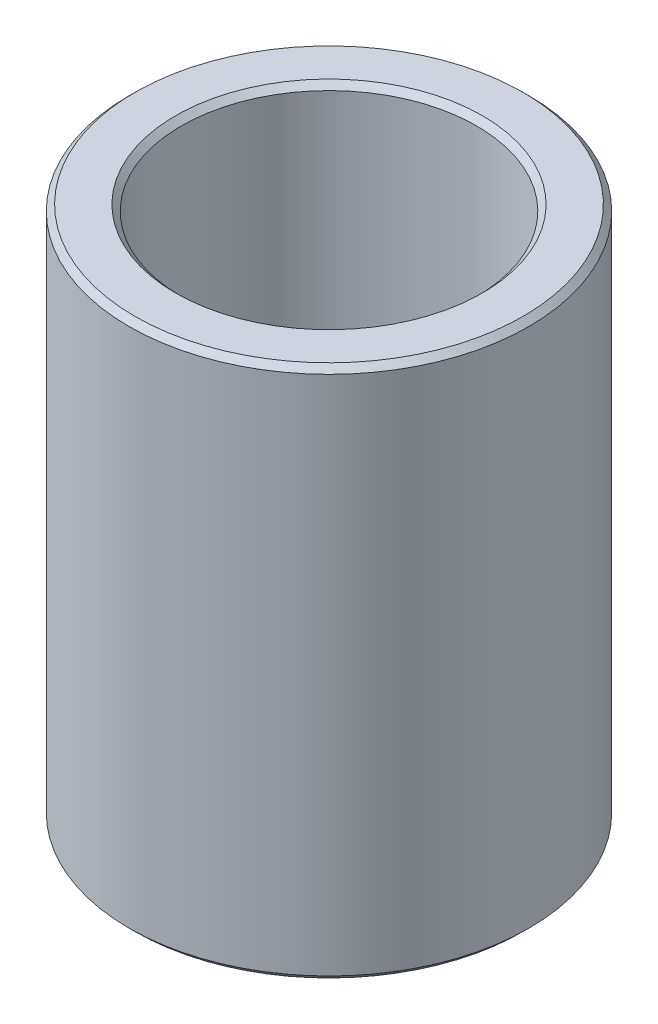
ISO-10303-21;
HEADER;
FILE_DESCRIPTION(('STEP AP214'),'2;1');
FILE_NAME('part.step','',(''),(''),'','','');
FILE_SCHEMA(('AUTOMOTIVE_DESIGN { 1 0 10303 214 1 1 1 1 }'));
ENDSEC;
DATA;
#1=APPLICATION_CONTEXT('core data for automotive mechanical design processes');
#2=APPLICATION_PROTOCOL_DEFINITION('international standard','automotive_design',2000,#1);
#3=PRODUCT_CONTEXT('',#1,'mechanical');
#4=PRODUCT('Part','Part','',(#3));
#5=PRODUCT_RELATED_PRODUCT_CATEGORY('part','',(#4));
#6=PRODUCT_DEFINITION_FORMATION('','',#4);
#7=PRODUCT_DEFINITION_CONTEXT('part definition',#1,'design');
#8=PRODUCT_DEFINITION('design','',#6,#7);
#9=PRODUCT_DEFINITION_SHAPE('','',#8);
#10=(LENGTH_UNIT() NAMED_UNIT(*) SI_UNIT(.MILLI.,.METRE.));
#11=(NAMED_UNIT(*) PLANE_ANGLE_UNIT() SI_UNIT($,.RADIAN.));
#12=(NAMED_UNIT(*) SI_UNIT($,.STERADIAN.) SOLID_ANGLE_UNIT());
#13=UNCERTAINTY_MEASURE_WITH_UNIT(LENGTH_MEASURE(1.E-05),#10,'distance_accuracy_value','');
#14=(GEOMETRIC_REPRESENTATION_CONTEXT(3) GLOBAL_UNCERTAINTY_ASSIGNED_CONTEXT((#13)) GLOBAL_UNIT_ASSIGNED_CONTEXT((#10,
#11,#12)) REPRESENTATION_CONTEXT('',''));
#15=CARTESIAN_POINT('',(0.,0.,0.));
#16=DIRECTION('',(0.,0.,1.));
#17=DIRECTION('',(1.,0.,0.));
#18=AXIS2_PLACEMENT_3D('',#15,#16,#17);
#19=CARTESIAN_POINT('',(0.,139.917964699464,0.));
#20=DIRECTION('',(0.,-1.,0.));
#21=DIRECTION('',(0.,0.,-1.));
#22=AXIS2_PLACEMENT_3D('',#19,#20,#21);
#23=CYLINDRICAL_SURFACE('',#22,52.5);
#24=CARTESIAN_POINT('',(0.,1.53916398300438,0.));
#25=DIRECTION('',(0.,1.,0.));
#26=DIRECTION('',(0.,0.,1.));
#27=AXIS2_PLACEMENT_3D('',#24,#25,#26);
#28=CIRCLE('',#27,52.5);
#29=CARTESIAN_POINT('',(0.,1.53916398300438,52.5));
#30=VERTEX_POINT('',#29);
#31=EDGE_CURVE('E10',#30,#30,#28,.T.);
#32=ORIENTED_EDGE('',*,*,#31,.T.);
#33=EDGE_LOOP('',(#32));
#34=FACE_BOUND('',#33,.T.);
#35=CARTESIAN_POINT('',(0.,138.37880071646,0.));
#36=DIRECTION('',(0.,1.,0.));
#37=DIRECTION('',(0.,0.,1.));
#38=AXIS2_PLACEMENT_3D('',#35,#36,#37);
#39=CIRCLE('',#38,52.5);
#40=CARTESIAN_POINT('',(0.,138.37880071646,52.5));
#41=VERTEX_POINT('',#40);
#42=EDGE_CURVE('E50',#41,#41,#39,.F.);
#43=ORIENTED_EDGE('',*,*,#42,.T.);
#44=EDGE_LOOP('',(#43));
#45=FACE_BOUND('',#44,.T.);
#46=ADVANCED_FACE('F39',(#34,#45),#23,.T.);
#47=CARTESIAN_POINT('',(0.,139.917964699464,0.));
#48=DIRECTION('',(0.,1.,0.));
#49=DIRECTION('',(0.,0.,1.));
#50=AXIS2_PLACEMENT_3D('',#47,#48,#49);
#51=PLANE('',#50);
#52=CARTESIAN_POINT('',(0.,139.917964699464,0.));
#53=DIRECTION('',(0.,1.,0.));
#54=DIRECTION('',(0.,0.,1.));
#55=AXIS2_PLACEMENT_3D('',#52,#53,#54);
#56=CIRCLE('',#55,40.3175745617392);
#57=CARTESIAN_POINT('',(0.,139.917964699464,40.3175745617392));
#58=VERTEX_POINT('',#57);
#59=EDGE_CURVE('E58',#58,#58,#56,.F.);
#60=ORIENTED_EDGE('',*,*,#59,.T.);
#61=EDGE_LOOP('',(#60));
#62=FACE_BOUND('',#61,.T.);
#63=CARTESIAN_POINT('',(0.,139.917964699464,0.));
#64=DIRECTION('',(0.,1.,0.));
#65=DIRECTION('',(0.,0.,1.));
#66=AXIS2_PLACEMENT_3D('',#63,#64,#65);
#67=CIRCLE('',#66,50.9608360169956);
#68=CARTESIAN_POINT('',(0.,139.917964699464,50.9608360169956));
#69=VERTEX_POINT('',#68);
#70=EDGE_CURVE('E61',#69,#69,#67,.T.);
#71=ORIENTED_EDGE('',*,*,#70,.T.);
#72=EDGE_LOOP('',(#71));
#73=FACE_BOUND('',#72,.T.);
#74=ADVANCED_FACE('F88',(#62,#73),#51,.T.);
#75=CARTESIAN_POINT('',(0.,0.,0.));
#76=DIRECTION('',(0.,1.,0.));
#77=DIRECTION('',(0.,0.,1.));
#78=AXIS2_PLACEMENT_3D('',#75,#76,#77);
#79=PLANE('',#78);
#80=CARTESIAN_POINT('',(0.,0.,0.));
#81=DIRECTION('',(0.,1.,0.));
#82=DIRECTION('',(0.,0.,1.));
#83=AXIS2_PLACEMENT_3D('',#80,#81,#82);
#84=CIRCLE('',#83,40.3175745617391);
#85=CARTESIAN_POINT('',(0.,0.,40.3175745617391));
#86=VERTEX_POINT('',#85);
#87=EDGE_CURVE('E51',#86,#86,#84,.T.);
#88=ORIENTED_EDGE('',*,*,#87,.T.);
#89=EDGE_LOOP('',(#88));
#90=FACE_BOUND('',#89,.T.);
#91=CARTESIAN_POINT('',(0.,0.,0.));
#92=DIRECTION('',(0.,1.,0.));
#93=DIRECTION('',(0.,0.,1.));
#94=AXIS2_PLACEMENT_3D('',#91,#92,#93);
#95=CIRCLE('',#94,50.9608360169956);
#96=CARTESIAN_POINT('',(0.,0.,50.9608360169956));
#97=VERTEX_POINT('',#96);
#98=EDGE_CURVE('E54',#97,#97,#95,.F.);
#99=ORIENTED_EDGE('',*,*,#98,.T.);
#100=EDGE_LOOP('',(#99));
#101=FACE_BOUND('',#100,.T.);
#102=ADVANCED_FACE('F83',(#90,#101),#79,.F.);
#103=CARTESIAN_POINT('',(0.,139.917964699464,0.));
#104=DIRECTION('',(0.,-1.,0.));
#105=DIRECTION('',(0.,0.,-1.));
#106=AXIS2_PLACEMENT_3D('',#103,#104,#105);
#107=CYLINDRICAL_SURFACE('',#106,38.7784105787348);
#108=CARTESIAN_POINT('',(0.,138.37880071646,0.));
#109=DIRECTION('',(0.,1.,0.));
#110=DIRECTION('',(0.,0.,1.));
#111=AXIS2_PLACEMENT_3D('',#108,#109,#110);
#112=CIRCLE('',#111,38.7784105787348);
#113=CARTESIAN_POINT('',(0.,138.37880071646,38.7784105787348));
#114=VERTEX_POINT('',#113);
#115=EDGE_CURVE('E67',#114,#114,#112,.T.);
#116=ORIENTED_EDGE('',*,*,#115,.T.);
#117=EDGE_LOOP('',(#116));
#118=FACE_BOUND('',#117,.T.);
#119=CARTESIAN_POINT('',(0.,1.53916398300438,0.));
#120=DIRECTION('',(0.,1.,0.));
#121=DIRECTION('',(0.,0.,1.));
#122=AXIS2_PLACEMENT_3D('',#119,#120,#121);
#123=CIRCLE('',#122,38.7784105787348);
#124=CARTESIAN_POINT('',(0.,1.53916398300438,38.7784105787348));
#125=VERTEX_POINT('',#124);
#126=EDGE_CURVE('E69',#125,#125,#123,.F.);
#127=ORIENTED_EDGE('',*,*,#126,.T.);
#128=EDGE_LOOP('',(#127));
#129=FACE_BOUND('',#128,.T.);
#130=ADVANCED_FACE('F71',(#118,#129),#107,.F.);
#131=CARTESIAN_POINT('',(0.,138.37880071646,0.));
#132=DIRECTION('',(0.,1.,0.));
#133=DIRECTION('',(0.,0.,1.));
#134=AXIS2_PLACEMENT_3D('',#131,#132,#133);
#135=CONICAL_SURFACE('',#134,38.7784105787348,0.785398163397453);
#136=ORIENTED_EDGE('',*,*,#59,.F.);
#137=EDGE_LOOP('',(#136));
#138=FACE_BOUND('',#137,.T.);
#139=ORIENTED_EDGE('',*,*,#115,.F.);
#140=EDGE_LOOP('',(#139));
#141=FACE_BOUND('',#140,.T.);
#142=ADVANCED_FACE('F77',(#138,#141),#135,.F.);
#143=CARTESIAN_POINT('',(0.,0.,0.));
#144=DIRECTION('',(0.,-1.,0.));
#145=DIRECTION('',(0.,0.,-1.));
#146=AXIS2_PLACEMENT_3D('',#143,#144,#145);
#147=CONICAL_SURFACE('',#146,40.3175745617391,0.785398163397444);
#148=ORIENTED_EDGE('',*,*,#126,.F.);
#149=EDGE_LOOP('',(#148));
#150=FACE_BOUND('',#149,.T.);
#151=ORIENTED_EDGE('',*,*,#87,.F.);
#152=EDGE_LOOP('',(#151));
#153=FACE_BOUND('',#152,.T.);
#154=ADVANCED_FACE('F73',(#150,#153),#147,.F.);
#155=CARTESIAN_POINT('',(0.,1.53916398300438,0.));
#156=DIRECTION('',(0.,1.,0.));
#157=DIRECTION('',(0.,0.,1.));
#158=AXIS2_PLACEMENT_3D('',#155,#156,#157);
#159=CONICAL_SURFACE('',#158,52.5,0.785398163397455);
#160=ORIENTED_EDGE('',*,*,#98,.F.);
#161=EDGE_LOOP('',(#160));
#162=FACE_BOUND('',#161,.T.);
#163=ORIENTED_EDGE('',*,*,#31,.F.);
#164=EDGE_LOOP('',(#163));
#165=FACE_BOUND('',#164,.T.);
#166=ADVANCED_FACE('F76',(#162,#165),#159,.T.);
#167=CARTESIAN_POINT('',(0.,139.917964699464,0.));
#168=DIRECTION('',(0.,-1.,0.));
#169=DIRECTION('',(0.,0.,-1.));
#170=AXIS2_PLACEMENT_3D('',#167,#168,#169);
#171=CONICAL_SURFACE('',#170,50.9608360169956,0.78539816339745);
#172=ORIENTED_EDGE('',*,*,#42,.F.);
#173=EDGE_LOOP('',(#172));
#174=FACE_BOUND('',#173,.T.);
#175=ORIENTED_EDGE('',*,*,#70,.F.);
#176=EDGE_LOOP('',(#175));
#177=FACE_BOUND('',#176,.T.);
#178=ADVANCED_FACE('F45',(#174,#177),#171,.T.);
#179=CLOSED_SHELL('',(#46,#74,#102,#130,#142,#154,#166,#178));
#180=MANIFOLD_SOLID_BREP('B2',#179);
#181=ADVANCED_BREP_SHAPE_REPRESENTATION('',(#18,#180),#14);
#182=SHAPE_DEFINITION_REPRESENTATION(#9,#181);
ENDSEC;
END-ISO-10303-21;
